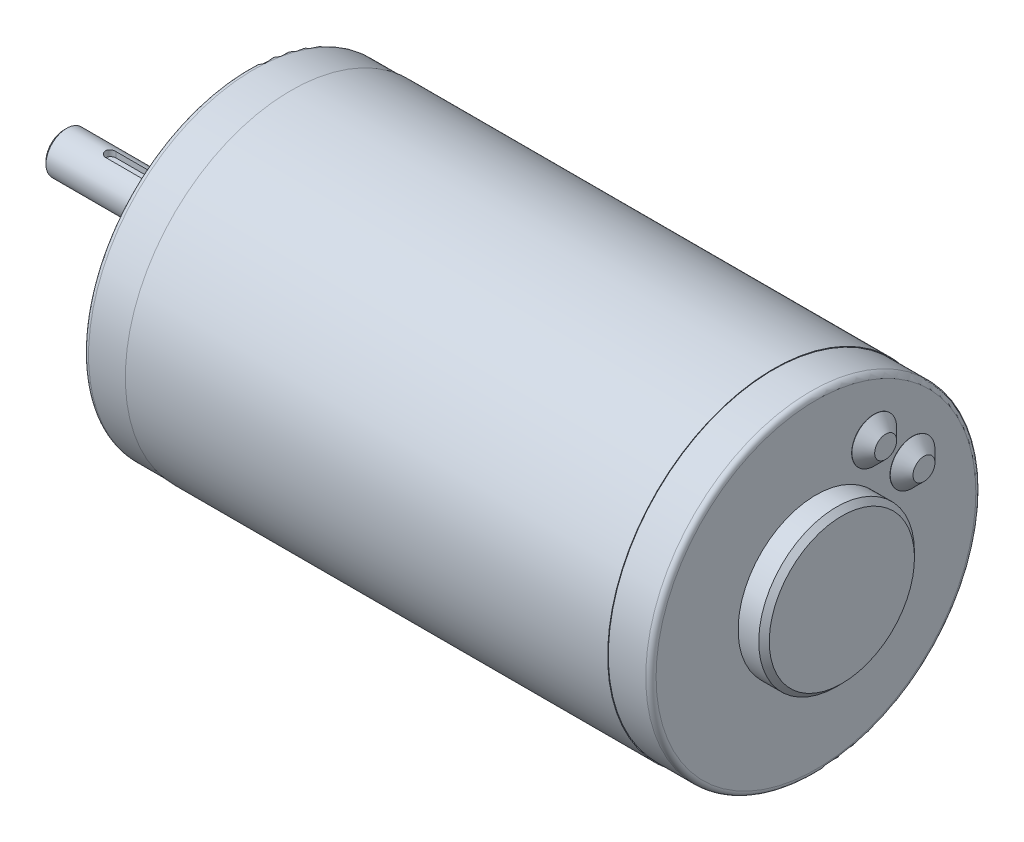
ISO-10303-21;
HEADER;
FILE_DESCRIPTION(('STEP AP214'),'2;1');
FILE_NAME('part.step','',(''),(''),'','','');
FILE_SCHEMA(('AUTOMOTIVE_DESIGN { 1 0 10303 214 1 1 1 1 }'));
ENDSEC;
DATA;
#1=APPLICATION_CONTEXT('core data for automotive mechanical design processes');
#2=APPLICATION_PROTOCOL_DEFINITION('international standard','automotive_design',2000,#1);
#3=PRODUCT_CONTEXT('',#1,'mechanical');
#4=PRODUCT('Part','Part','',(#3));
#5=PRODUCT_RELATED_PRODUCT_CATEGORY('part','',(#4));
#6=PRODUCT_DEFINITION_FORMATION('','',#4);
#7=PRODUCT_DEFINITION_CONTEXT('part definition',#1,'design');
#8=PRODUCT_DEFINITION('design','',#6,#7);
#9=PRODUCT_DEFINITION_SHAPE('','',#8);
#10=(LENGTH_UNIT() NAMED_UNIT(*) SI_UNIT(.MILLI.,.METRE.));
#11=(NAMED_UNIT(*) PLANE_ANGLE_UNIT() SI_UNIT($,.RADIAN.));
#12=(NAMED_UNIT(*) SI_UNIT($,.STERADIAN.) SOLID_ANGLE_UNIT());
#13=UNCERTAINTY_MEASURE_WITH_UNIT(LENGTH_MEASURE(1.E-05),#10,'distance_accuracy_value','');
#14=(GEOMETRIC_REPRESENTATION_CONTEXT(3) GLOBAL_UNCERTAINTY_ASSIGNED_CONTEXT((#13)) GLOBAL_UNIT_ASSIGNED_CONTEXT((#10,
#11,#12)) REPRESENTATION_CONTEXT('',''));
#15=CARTESIAN_POINT('',(0.,0.,0.));
#16=DIRECTION('',(0.,0.,1.));
#17=DIRECTION('',(1.,0.,0.));
#18=AXIS2_PLACEMENT_3D('',#15,#16,#17);
#19=CARTESIAN_POINT('',(-27.6,2.79999999999999,-1.));
#20=DIRECTION('',(0.,-1.,0.));
#21=DIRECTION('',(0.,0.,-1.));
#22=AXIS2_PLACEMENT_3D('',#19,#20,#21);
#23=PLANE('',#22);
#24=CARTESIAN_POINT('',(-7.1,2.79999999999999,0.));
#25=DIRECTION('',(0.,1.,0.));
#26=DIRECTION('',(0.,0.,1.));
#27=AXIS2_PLACEMENT_3D('',#24,#25,#26);
#28=CIRCLE('',#27,1.);
#29=CARTESIAN_POINT('',(-7.1,2.79999999999999,1.));
#30=VERTEX_POINT('',#29);
#31=CARTESIAN_POINT('',(-7.1,2.79999999999999,-1.));
#32=VERTEX_POINT('',#31);
#33=EDGE_CURVE('E79',#30,#32,#28,.T.);
#34=ORIENTED_EDGE('',*,*,#33,.T.);
#35=DIRECTION('',(1.,0.,0.));
#36=VECTOR('',#35,1.);
#37=CARTESIAN_POINT('',(-27.6,2.79999999999999,-1.));
#38=LINE('',#37,#36);
#39=CARTESIAN_POINT('',(-26.6,2.79999999999999,-1.));
#40=VERTEX_POINT('',#39);
#41=EDGE_CURVE('E74',#40,#32,#38,.T.);
#42=ORIENTED_EDGE('',*,*,#41,.F.);
#43=CARTESIAN_POINT('',(-26.6,2.79999999999999,0.));
#44=DIRECTION('',(0.,-1.,0.));
#45=DIRECTION('',(0.,0.,-1.));
#46=AXIS2_PLACEMENT_3D('',#43,#44,#45);
#47=CIRCLE('',#46,1.);
#48=CARTESIAN_POINT('',(-26.6,2.79999999999999,1.));
#49=VERTEX_POINT('',#48);
#50=EDGE_CURVE('E76',#40,#49,#47,.F.);
#51=ORIENTED_EDGE('',*,*,#50,.T.);
#52=DIRECTION('',(1.,0.,0.));
#53=VECTOR('',#52,1.);
#54=CARTESIAN_POINT('',(-27.6,2.79999999999999,1.));
#55=LINE('',#54,#53);
#56=EDGE_CURVE('E102',#49,#30,#55,.T.);
#57=ORIENTED_EDGE('',*,*,#56,.T.);
#58=EDGE_LOOP('',(#34,#42,#51,#57));
#59=FACE_BOUND('',#58,.T.);
#60=ADVANCED_FACE('F16',(#59),#23,.F.);
#61=CARTESIAN_POINT('',(-35.6,0.,0.));
#62=DIRECTION('',(-1.,0.,0.));
#63=DIRECTION('',(0.,0.,1.));
#64=AXIS2_PLACEMENT_3D('',#61,#62,#63);
#65=PLANE('',#64);
#66=CARTESIAN_POINT('',(-35.6000000000449,0.,0.));
#67=DIRECTION('',(1.,0.,0.));
#68=DIRECTION('',(0.,0.,-1.));
#69=AXIS2_PLACEMENT_3D('',#66,#67,#68);
#70=CIRCLE('',#69,3.49999999997408);
#71=CARTESIAN_POINT('',(-35.6000000000449,0.,-3.49999999997408));
#72=VERTEX_POINT('',#71);
#73=EDGE_CURVE('E325',#72,#72,#70,.T.);
#74=ORIENTED_EDGE('',*,*,#73,.F.);
#75=EDGE_LOOP('',(#74));
#76=FACE_BOUND('',#75,.T.);
#77=ADVANCED_FACE('F578',(#76),#65,.T.);
#78=CARTESIAN_POINT('',(-26.6,3.87298334620741,0.));
#79=DIRECTION('',(0.,-1.,0.));
#80=DIRECTION('',(0.,0.,-1.));
#81=AXIS2_PLACEMENT_3D('',#78,#79,#80);
#82=CYLINDRICAL_SURFACE('',#81,1.);
#83=CARTESIAN_POINT('',(-26.6,3.87298334620741,1.));
#84=CARTESIAN_POINT('',(-26.6276629851065,3.87298148580177,1.00000033749611));
#85=CARTESIAN_POINT('',(-26.6553122630182,3.8732800994947,0.998851407375366));
#86=CARTESIAN_POINT('',(-26.7104040353036,3.87445904774558,0.994271295395754));
#87=CARTESIAN_POINT('',(-26.7378465636871,3.87533928441687,0.990840497572679));
#88=CARTESIAN_POINT('',(-26.8194531732088,3.87881710972053,0.977175239382526));
#89=CARTESIAN_POINT('',(-26.8730564684822,3.88225203148808,0.963567695172493));
#90=CARTESIAN_POINT('',(-26.977124673782,3.89095422588002,0.927798076247996));
#91=CARTESIAN_POINT('',(-27.0275898782129,3.89622132630929,0.905636805423835));
#92=CARTESIAN_POINT('',(-27.1241114486473,3.90799134471939,0.853415378025864));
#93=CARTESIAN_POINT('',(-27.170166627891,3.91449459395647,0.823353103356932));
#94=CARTESIAN_POINT('',(-27.2575438819061,3.92816262398025,0.755484471828069));
#95=CARTESIAN_POINT('',(-27.2987548862455,3.93533791028915,0.717537268783975));
#96=CARTESIAN_POINT('',(-27.3743020894827,3.94945104396193,0.635275780516229));
#97=CARTESIAN_POINT('',(-27.4086371894679,3.95638885322537,0.59096047947883));
#98=CARTESIAN_POINT('',(-27.4699110016186,3.96936182283248,0.496456899401689));
#99=CARTESIAN_POINT('',(-27.496739895984,3.9753830468173,0.446195340334472));
#100=CARTESIAN_POINT('',(-27.5415247341967,3.98572346250588,0.341702590842916));
#101=CARTESIAN_POINT('',(-27.5594824242998,3.990042989147,0.287472184083007));
#102=CARTESIAN_POINT('',(-27.5856589927774,3.99641900005128,0.177744108525158));
#103=CARTESIAN_POINT('',(-27.5940676724228,3.998519529013,0.122294322002856));
#104=CARTESIAN_POINT('',(-27.6015033715433,4.00037438150815,0.0107327756816781));
#105=CARTESIAN_POINT('',(-27.6005315701923,4.00012899993444,-0.0453789000287067));
#106=CARTESIAN_POINT('',(-27.5893700363146,3.99735237365735,-0.155352492972096));
#107=CARTESIAN_POINT('',(-27.5793853834005,3.9948719867736,-0.209236701739855));
#108=CARTESIAN_POINT('',(-27.5508113208173,3.98796330636495,-0.31453871108434));
#109=CARTESIAN_POINT('',(-27.5322215304314,3.98353492665556,-0.365956402423988));
#110=CARTESIAN_POINT('',(-27.4867987193294,3.97314997761798,-0.46540728602454));
#111=CARTESIAN_POINT('',(-27.4598926057672,3.96717993827555,-0.513405629602248));
#112=CARTESIAN_POINT('',(-27.3986568701665,3.95435945541919,-0.604276631230015));
#113=CARTESIAN_POINT('',(-27.3643261297468,3.94750887933198,-0.64714851556229));
#114=CARTESIAN_POINT('',(-27.2881210879187,3.93345566022865,-0.727769389708492));
#115=CARTESIAN_POINT('',(-27.2460683634602,3.92624850477685,-0.765349103054128));
#116=CARTESIAN_POINT('',(-27.1561701330723,3.91246168284006,-0.832969575186237));
#117=CARTESIAN_POINT('',(-27.1083230467164,3.90588218842993,-0.863008270245062));
#118=CARTESIAN_POINT('',(-27.0078544021762,3.89407813586325,-0.914804709285961));
#119=CARTESIAN_POINT('',(-26.9552085351039,3.88886106009136,-0.936517017887269));
#120=CARTESIAN_POINT('',(-26.8468830715817,3.88047058807054,-0.970702351849828));
#121=CARTESIAN_POINT('',(-26.7912081448502,3.87729413761435,-0.983189189212131));
#122=CARTESIAN_POINT('',(-26.7125426192411,3.87455290681524,-0.993904635150938));
#123=CARTESIAN_POINT('',(-26.6900802967868,3.87396523110859,-0.996190790966708));
#124=CARTESIAN_POINT('',(-26.6450822100907,3.87318062488974,-0.999236757697394));
#125=CARTESIAN_POINT('',(-26.6225466240447,3.87298306219461,-0.999999038096045));
#126=CARTESIAN_POINT('',(-26.6,3.87298334620741,-1.));
#127=B_SPLINE_CURVE_WITH_KNOTS('',3,(#83,#84,#85,#86,#87,#88,#89,#90,#91,#92,#93,#94,#95,#96,
#97,#98,#99,#100,#101,#102,#103,#104,#105,#106,#107,#108,#109,#110,#111,#112,#113,#114,#115,
#116,#117,#118,#119,#120,#121,#122,#123,#124,#125,#126),.UNSPECIFIED.,.F.,.F.,(4,2,2,2,2,2,2,2,
2,2,2,2,2,2,2,2,2,2,2,2,2,4),(0.,0.0829365303397727,0.165859106084653,0.331229963080318,
0.496585282091499,0.661984974726751,0.830641897427976,0.999325753539196,1.17036187098235,
1.34136430732425,1.50890481515325,1.67642426256639,1.84022545479276,2.00403389475838,
2.16932509450376,2.33464120964329,2.50441429534542,2.67423379180967,2.84496720161068,
3.01544447539986,3.08315848722649,3.15076267731671),.UNSPECIFIED.);
#128=CARTESIAN_POINT('',(-26.6,3.87298334620741,1.));
#129=VERTEX_POINT('',#128);
#130=CARTESIAN_POINT('',(-26.6,3.87298334620741,-1.));
#131=VERTEX_POINT('',#130);
#132=EDGE_CURVE('E160',#129,#131,#127,.T.);
#133=ORIENTED_EDGE('',*,*,#132,.F.);
#134=DIRECTION('',(0.,1.,0.));
#135=VECTOR('',#134,1.);
#136=CARTESIAN_POINT('',(-26.6,2.79999999999999,1.));
#137=LINE('',#136,#135);
#138=EDGE_CURVE('E89',#129,#49,#137,.F.);
#139=ORIENTED_EDGE('',*,*,#138,.T.);
#140=ORIENTED_EDGE('',*,*,#50,.F.);
#141=DIRECTION('',(0.,1.,0.));
#142=VECTOR('',#141,1.);
#143=CARTESIAN_POINT('',(-26.6,2.79999999999999,-1.));
#144=LINE('',#143,#142);
#145=EDGE_CURVE('E83',#131,#40,#144,.F.);
#146=ORIENTED_EDGE('',*,*,#145,.F.);
#147=EDGE_LOOP('',(#133,#139,#140,#146));
#148=FACE_BOUND('',#147,.T.);
#149=ADVANCED_FACE('F86',(#148),#82,.F.);
#150=CARTESIAN_POINT('',(-27.6,2.79999999999999,-1.));
#151=DIRECTION('',(0.,0.,1.));
#152=DIRECTION('',(1.,0.,0.));
#153=AXIS2_PLACEMENT_3D('',#150,#151,#152);
#154=PLANE('',#153);
#155=DIRECTION('',(1.,0.,0.));
#156=VECTOR('',#155,1.);
#157=CARTESIAN_POINT('',(0.,3.87298334620741,-1.));
#158=LINE('',#157,#156);
#159=CARTESIAN_POINT('',(-7.1,3.87298334620741,-1.));
#160=VERTEX_POINT('',#159);
#161=EDGE_CURVE('E94',#131,#160,#158,.T.);
#162=ORIENTED_EDGE('',*,*,#161,.F.);
#163=ORIENTED_EDGE('',*,*,#145,.T.);
#164=ORIENTED_EDGE('',*,*,#41,.T.);
#165=DIRECTION('',(0.,1.,0.));
#166=VECTOR('',#165,1.);
#167=CARTESIAN_POINT('',(-7.1,2.79999999999999,-1.));
#168=LINE('',#167,#166);
#169=EDGE_CURVE('E97',#32,#160,#168,.T.);
#170=ORIENTED_EDGE('',*,*,#169,.T.);
#171=EDGE_LOOP('',(#162,#163,#164,#170));
#172=FACE_BOUND('',#171,.T.);
#173=ADVANCED_FACE('F92',(#172),#154,.T.);
#174=CARTESIAN_POINT('',(-7.1,2.79999999999999,0.));
#175=DIRECTION('',(0.,1.,0.));
#176=DIRECTION('',(0.,0.,1.));
#177=AXIS2_PLACEMENT_3D('',#174,#175,#176);
#178=CYLINDRICAL_SURFACE('',#177,1.);
#179=ORIENTED_EDGE('',*,*,#33,.F.);
#180=DIRECTION('',(0.,1.,0.));
#181=VECTOR('',#180,1.);
#182=CARTESIAN_POINT('',(-7.1,2.79999999999999,1.));
#183=LINE('',#182,#181);
#184=CARTESIAN_POINT('',(-7.1,3.87298334620741,1.));
#185=VERTEX_POINT('',#184);
#186=EDGE_CURVE('E103',#30,#185,#183,.T.);
#187=ORIENTED_EDGE('',*,*,#186,.T.);
#188=CARTESIAN_POINT('',(-7.1,3.87298334620741,-1.));
#189=CARTESIAN_POINT('',(-7.07233701489346,3.87298148580177,-1.00000033749611));
#190=CARTESIAN_POINT('',(-7.04468773698177,3.8732800994947,-0.998851407375366));
#191=CARTESIAN_POINT('',(-6.98959596469644,3.87445904774558,-0.994271295395754));
#192=CARTESIAN_POINT('',(-6.96215343631291,3.87533928441687,-0.990840497572679));
#193=CARTESIAN_POINT('',(-6.88054682679116,3.87881710972053,-0.977175239382526));
#194=CARTESIAN_POINT('',(-6.82694353151779,3.88225203148808,-0.963567695172493));
#195=CARTESIAN_POINT('',(-6.72287532621804,3.89095422588002,-0.927798076247997));
#196=CARTESIAN_POINT('',(-6.67241012178714,3.89622132630929,-0.905636805423836));
#197=CARTESIAN_POINT('',(-6.57588855135267,3.90799134471939,-0.853415378025865));
#198=CARTESIAN_POINT('',(-6.52983337210904,3.91449459395647,-0.823353103356933));
#199=CARTESIAN_POINT('',(-6.4424561180939,3.92816262398025,-0.755484471828069));
#200=CARTESIAN_POINT('',(-6.40124511375448,3.93533791028915,-0.717537268783976));
#201=CARTESIAN_POINT('',(-6.32569791051729,3.94945104396193,-0.63527578051623));
#202=CARTESIAN_POINT('',(-6.29136281053206,3.95638885322537,-0.590960479478831));
#203=CARTESIAN_POINT('',(-6.23008899838136,3.96936182283248,-0.496456899401691));
#204=CARTESIAN_POINT('',(-6.20326010401603,3.9753830468173,-0.446195340334474));
#205=CARTESIAN_POINT('',(-6.1584752658033,3.98572346250588,-0.341702590842919));
#206=CARTESIAN_POINT('',(-6.14051757570017,3.990042989147,-0.28747218408301));
#207=CARTESIAN_POINT('',(-6.11434100722257,3.99641900005128,-0.17774410852516));
#208=CARTESIAN_POINT('',(-6.10593232757718,3.998519529013,-0.122294322002858));
#209=CARTESIAN_POINT('',(-6.09849662845671,4.00037438150815,-0.0107327756816796));
#210=CARTESIAN_POINT('',(-6.09946842980766,4.00012899993444,0.0453789000287057));
#211=CARTESIAN_POINT('',(-6.11062996368545,3.99735237365735,0.155352492972096));
#212=CARTESIAN_POINT('',(-6.12061461659948,3.9948719867736,0.209236701739855));
#213=CARTESIAN_POINT('',(-6.14918867918275,3.98796330636495,0.31453871108434));
#214=CARTESIAN_POINT('',(-6.16777846956858,3.98353492665556,0.365956402423988));
#215=CARTESIAN_POINT('',(-6.21320128067065,3.97314997761798,0.465407286024539));
#216=CARTESIAN_POINT('',(-6.24010739423284,3.96717993827555,0.513405629602248));
#217=CARTESIAN_POINT('',(-6.30134312983347,3.95435945541919,0.604276631230014));
#218=CARTESIAN_POINT('',(-6.33567387025322,3.94750887933198,0.647148515562289));
#219=CARTESIAN_POINT('',(-6.41187891208131,3.93345566022865,0.72776938970849));
#220=CARTESIAN_POINT('',(-6.45393163653981,3.92624850477685,0.765349103054127));
#221=CARTESIAN_POINT('',(-6.54382986692773,3.91246168284006,0.832969575186237));
#222=CARTESIAN_POINT('',(-6.59167695328356,3.90588218842993,0.863008270245062));
#223=CARTESIAN_POINT('',(-6.69214559782377,3.89407813586325,0.914804709285962));
#224=CARTESIAN_POINT('',(-6.74479146489609,3.88886106009136,0.936517017887269));
#225=CARTESIAN_POINT('',(-6.85311692841829,3.88047058807055,0.970702351849829));
#226=CARTESIAN_POINT('',(-6.90879185514984,3.87729413761435,0.983189189212132));
#227=CARTESIAN_POINT('',(-6.9874573807589,3.87455290681524,0.993904635150938));
#228=CARTESIAN_POINT('',(-7.00991970321318,3.87396523110859,0.996190790966708));
#229=CARTESIAN_POINT('',(-7.05491778990932,3.87318062488974,0.999236757697394));
#230=CARTESIAN_POINT('',(-7.07745337595529,3.87298306219461,0.999999038096045));
#231=CARTESIAN_POINT('',(-7.1,3.87298334620741,1.));
#232=B_SPLINE_CURVE_WITH_KNOTS('',3,(#188,#189,#190,#191,#192,#193,#194,#195,#196,#197,#198,
#199,#200,#201,#202,#203,#204,#205,#206,#207,#208,#209,#210,#211,#212,#213,#214,#215,#216,#217,
#218,#219,#220,#221,#222,#223,#224,#225,#226,#227,#228,#229,#230,#231),.UNSPECIFIED.,.F.,.F.,(4,
2,2,2,2,2,2,2,2,2,2,2,2,2,2,2,2,2,2,2,2,4),(0.,0.0829365303397693,0.165859106084651,
0.331229963080317,0.496585282091498,0.661984974726749,0.830641897427974,0.999325753539193,
1.17036187098235,1.34136430732424,1.50890481515325,1.67642426256639,1.84022545479276,
2.00403389475838,2.16932509450376,2.33464120964329,2.50441429534542,2.67423379180967,
2.84496720161068,3.01544447539986,3.08315848722648,3.15076267731671),.UNSPECIFIED.);
#233=EDGE_CURVE('E151',#160,#185,#232,.T.);
#234=ORIENTED_EDGE('',*,*,#233,.F.);
#235=ORIENTED_EDGE('',*,*,#169,.F.);
#236=EDGE_LOOP('',(#179,#187,#234,#235));
#237=FACE_BOUND('',#236,.T.);
#238=ADVANCED_FACE('F166',(#237),#178,.F.);
#239=CARTESIAN_POINT('',(-27.6,2.79999999999999,1.));
#240=DIRECTION('',(0.,0.,1.));
#241=DIRECTION('',(1.,0.,0.));
#242=AXIS2_PLACEMENT_3D('',#239,#240,#241);
#243=PLANE('',#242);
#244=ORIENTED_EDGE('',*,*,#186,.F.);
#245=ORIENTED_EDGE('',*,*,#56,.F.);
#246=ORIENTED_EDGE('',*,*,#138,.F.);
#247=DIRECTION('',(1.,0.,0.));
#248=VECTOR('',#247,1.);
#249=CARTESIAN_POINT('',(0.,3.87298334620741,1.));
#250=LINE('',#249,#248);
#251=EDGE_CURVE('E159',#185,#129,#250,.F.);
#252=ORIENTED_EDGE('',*,*,#251,.F.);
#253=EDGE_LOOP('',(#244,#245,#246,#252));
#254=FACE_BOUND('',#253,.T.);
#255=ADVANCED_FACE('F181',(#254),#243,.F.);
#256=CARTESIAN_POINT('',(-35.0999999999999,0.,0.));
#257=DIRECTION('',(1.,0.,0.));
#258=DIRECTION('',(0.,0.,-1.));
#259=AXIS2_PLACEMENT_3D('',#256,#257,#258);
#260=CONICAL_SURFACE('',#259,3.99999999996226,0.785398163340605);
#261=ORIENTED_EDGE('',*,*,#73,.T.);
#262=EDGE_LOOP('',(#261));
#263=FACE_BOUND('',#262,.T.);
#264=CARTESIAN_POINT('',(-35.1,0.,0.));
#265=DIRECTION('',(1.,0.,0.));
#266=DIRECTION('',(0.,0.,-1.));
#267=AXIS2_PLACEMENT_3D('',#264,#265,#266);
#268=CIRCLE('',#267,4.);
#269=CARTESIAN_POINT('',(-35.1,0.,-4.));
#270=VERTEX_POINT('',#269);
#271=EDGE_CURVE('E150',#270,#270,#268,.T.);
#272=ORIENTED_EDGE('',*,*,#271,.F.);
#273=EDGE_LOOP('',(#272));
#274=FACE_BOUND('',#273,.T.);
#275=ADVANCED_FACE('F176',(#263,#274),#260,.T.);
#276=CARTESIAN_POINT('',(0.,0.,0.));
#277=DIRECTION('',(1.,0.,0.));
#278=DIRECTION('',(0.,0.,-1.));
#279=AXIS2_PLACEMENT_3D('',#276,#277,#278);
#280=CYLINDRICAL_SURFACE('',#279,4.);
#281=ORIENTED_EDGE('',*,*,#271,.T.);
#282=EDGE_LOOP('',(#281));
#283=FACE_BOUND('',#282,.T.);
#284=CARTESIAN_POINT('',(-4.,0.,0.));
#285=DIRECTION('',(1.,0.,0.));
#286=DIRECTION('',(0.,0.,-1.));
#287=AXIS2_PLACEMENT_3D('',#284,#285,#286);
#288=CIRCLE('',#287,4.);
#289=CARTESIAN_POINT('',(-4.,0.,-4.));
#290=VERTEX_POINT('',#289);
#291=EDGE_CURVE('E147',#290,#290,#288,.T.);
#292=ORIENTED_EDGE('',*,*,#291,.F.);
#293=EDGE_LOOP('',(#292));
#294=FACE_BOUND('',#293,.T.);
#295=ORIENTED_EDGE('',*,*,#233,.T.);
#296=ORIENTED_EDGE('',*,*,#251,.T.);
#297=ORIENTED_EDGE('',*,*,#132,.T.);
#298=ORIENTED_EDGE('',*,*,#161,.T.);
#299=EDGE_LOOP('',(#295,#296,#297,#298));
#300=FACE_BOUND('',#299,.T.);
#301=ADVANCED_FACE('F170',(#283,#294,#300),#280,.T.);
#302=CARTESIAN_POINT('',(-4.,4.,0.));
#303=DIRECTION('',(-1.,0.,0.));
#304=DIRECTION('',(0.,0.,1.));
#305=AXIS2_PLACEMENT_3D('',#302,#303,#304);
#306=PLANE('',#305);
#307=ORIENTED_EDGE('',*,*,#291,.T.);
#308=EDGE_LOOP('',(#307));
#309=FACE_BOUND('',#308,.T.);
#310=CARTESIAN_POINT('',(-4.,0.,0.));
#311=DIRECTION('',(1.,0.,0.));
#312=DIRECTION('',(0.,1.,0.));
#313=AXIS2_PLACEMENT_3D('',#310,#311,#312);
#314=CIRCLE('',#313,8.509);
#315=CARTESIAN_POINT('',(-4.,8.509,0.));
#316=VERTEX_POINT('',#315);
#317=EDGE_CURVE('E144',#316,#316,#314,.T.);
#318=ORIENTED_EDGE('',*,*,#317,.F.);
#319=EDGE_LOOP('',(#318));
#320=FACE_BOUND('',#319,.T.);
#321=ADVANCED_FACE('F175',(#309,#320),#306,.T.);
#322=CARTESIAN_POINT('',(111.8479,18.6070906828553,-11.2073596390943));
#323=DIRECTION('',(1.,0.,0.));
#324=DIRECTION('',(0.,0.,-1.));
#325=AXIS2_PLACEMENT_3D('',#322,#323,#324);
#326=PLANE('',#325);
#327=CARTESIAN_POINT('',(111.84789999993,18.6070906828553,-11.2073596390943));
#328=DIRECTION('',(-1.,0.,0.));
#329=DIRECTION('',(0.,-1.,0.));
#330=AXIS2_PLACEMENT_3D('',#327,#328,#329);
#331=CIRCLE('',#330,2.11800000003146);
#332=CARTESIAN_POINT('',(111.84789999993,16.4890906828238,-11.2073596390943));
#333=VERTEX_POINT('',#332);
#334=EDGE_CURVE('E141',#333,#333,#331,.T.);
#335=ORIENTED_EDGE('',*,*,#334,.F.);
#336=EDGE_LOOP('',(#335));
#337=FACE_BOUND('',#336,.T.);
#338=ADVANCED_FACE('F530',(#337),#326,.T.);
#339=CARTESIAN_POINT('',(114.6,15.0368,0.));
#340=DIRECTION('',(1.,0.,0.));
#341=DIRECTION('',(0.,0.,-1.));
#342=AXIS2_PLACEMENT_3D('',#339,#340,#341);
#343=PLANE('',#342);
#344=CARTESIAN_POINT('',(114.6,0.,0.));
#345=DIRECTION('',(-1.,0.,0.));
#346=DIRECTION('',(0.,-1.,0.));
#347=AXIS2_PLACEMENT_3D('',#344,#345,#346);
#348=CIRCLE('',#347,14.0208);
#349=CARTESIAN_POINT('',(114.6,-14.0208,0.));
#350=VERTEX_POINT('',#349);
#351=EDGE_CURVE('E138',#350,#350,#348,.T.);
#352=ORIENTED_EDGE('',*,*,#351,.F.);
#353=EDGE_LOOP('',(#352));
#354=FACE_BOUND('',#353,.T.);
#355=ADVANCED_FACE('F521',(#354),#343,.T.);
#356=CARTESIAN_POINT('',(111.8479,11.2073596390943,-18.6070906828553));
#357=DIRECTION('',(1.,0.,0.));
#358=DIRECTION('',(0.,0.,-1.));
#359=AXIS2_PLACEMENT_3D('',#356,#357,#358);
#360=PLANE('',#359);
#361=CARTESIAN_POINT('',(111.84789999993,11.2073596390943,-18.6070906828553));
#362=DIRECTION('',(-1.,0.,0.));
#363=DIRECTION('',(0.,0.,1.));
#364=AXIS2_PLACEMENT_3D('',#361,#362,#363);
#365=CIRCLE('',#364,2.1180000000021);
#366=CARTESIAN_POINT('',(111.84789999993,11.2073596390943,-16.4890906828532));
#367=VERTEX_POINT('',#366);
#368=EDGE_CURVE('E134',#367,#367,#365,.T.);
#369=ORIENTED_EDGE('',*,*,#368,.F.);
#370=EDGE_LOOP('',(#369));
#371=FACE_BOUND('',#370,.T.);
#372=ADVANCED_FACE('F512',(#371),#360,.T.);
#373=CARTESIAN_POINT('',(13.6143999999945,25.4,0.));
#374=DIRECTION('',(-1.,0.,0.));
#375=DIRECTION('',(0.,0.,1.));
#376=AXIS2_PLACEMENT_3D('',#373,#374,#375);
#377=CONICAL_SURFACE('',#376,2.01929999997219,1.02974425867198);
#378=CARTESIAN_POINT('',(14.827717847993,25.4,0.));
#379=VERTEX_POINT('',#378);
#380=VERTEX_LOOP('',#379);
#381=FACE_BOUND('',#380,.T.);
#382=CARTESIAN_POINT('',(13.6144,25.4,0.));
#383=DIRECTION('',(-1.,0.,0.));
#384=DIRECTION('',(0.,0.,1.));
#385=AXIS2_PLACEMENT_3D('',#382,#383,#384);
#386=CIRCLE('',#385,2.0193);
#387=CARTESIAN_POINT('',(13.6144,25.4,2.0193));
#388=VERTEX_POINT('',#387);
#389=EDGE_CURVE('E137',#388,#388,#386,.T.);
#390=ORIENTED_EDGE('',*,*,#389,.T.);
#391=EDGE_LOOP('',(#390));
#392=FACE_BOUND('',#391,.T.);
#393=ADVANCED_FACE('F503',(#381,#392),#377,.F.);
#394=CARTESIAN_POINT('',(13.6143999999945,-25.4,0.));
#395=DIRECTION('',(-1.,0.,0.));
#396=DIRECTION('',(0.,0.,1.));
#397=AXIS2_PLACEMENT_3D('',#394,#395,#396);
#398=CONICAL_SURFACE('',#397,2.01929999997219,1.02974425867198);
#399=CARTESIAN_POINT('',(14.827717847993,-25.4,0.));
#400=VERTEX_POINT('',#399);
#401=VERTEX_LOOP('',#400);
#402=FACE_BOUND('',#401,.T.);
#403=CARTESIAN_POINT('',(13.6144,-25.4,0.));
#404=DIRECTION('',(-1.,0.,0.));
#405=DIRECTION('',(0.,0.,1.));
#406=AXIS2_PLACEMENT_3D('',#403,#404,#405);
#407=CIRCLE('',#406,2.0193);
#408=CARTESIAN_POINT('',(13.6144,-25.4,2.0193));
#409=VERTEX_POINT('',#408);
#410=EDGE_CURVE('E315',#409,#409,#407,.T.);
#411=ORIENTED_EDGE('',*,*,#410,.T.);
#412=EDGE_LOOP('',(#411));
#413=FACE_BOUND('',#412,.T.);
#414=ADVANCED_FACE('F494',(#402,#413),#398,.F.);
#415=CARTESIAN_POINT('',(-2.984,0.,0.));
#416=DIRECTION('',(1.,0.,0.));
#417=DIRECTION('',(0.,1.,0.));
#418=AXIS2_PLACEMENT_3D('',#415,#416,#417);
#419=CONICAL_SURFACE('',#418,9.525,0.78539816339745);
#420=ORIENTED_EDGE('',*,*,#317,.T.);
#421=EDGE_LOOP('',(#420));
#422=FACE_BOUND('',#421,.T.);
#423=CARTESIAN_POINT('',(-2.984,0.,0.));
#424=DIRECTION('',(1.,0.,0.));
#425=DIRECTION('',(0.,0.,-1.));
#426=AXIS2_PLACEMENT_3D('',#423,#424,#425);
#427=CIRCLE('',#426,9.525);
#428=CARTESIAN_POINT('',(-2.984,0.,-9.525));
#429=VERTEX_POINT('',#428);
#430=EDGE_CURVE('E312',#429,#429,#427,.T.);
#431=ORIENTED_EDGE('',*,*,#430,.F.);
#432=EDGE_LOOP('',(#431));
#433=FACE_BOUND('',#432,.T.);
#434=ADVANCED_FACE('F485',(#422,#433),#419,.T.);
#435=CARTESIAN_POINT('',(109.647900000027,18.6070906828553,-11.2073596390943));
#436=DIRECTION('',(-1.,0.,0.));
#437=DIRECTION('',(0.,-1.,0.));
#438=AXIS2_PLACEMENT_3D('',#435,#436,#437);
#439=CONICAL_SURFACE('',#438,4.31799999987712,0.785398163384529);
#440=CARTESIAN_POINT('',(109.6479,18.6070906828553,-11.2073596390943));
#441=DIRECTION('',(-1.,0.,0.));
#442=DIRECTION('',(0.,0.,1.));
#443=AXIS2_PLACEMENT_3D('',#440,#441,#442);
#444=CIRCLE('',#443,4.318);
#445=CARTESIAN_POINT('',(109.6479,18.6070906828553,-6.88935963909434));
#446=VERTEX_POINT('',#445);
#447=EDGE_CURVE('E309',#446,#446,#444,.T.);
#448=ORIENTED_EDGE('',*,*,#447,.F.);
#449=EDGE_LOOP('',(#448));
#450=FACE_BOUND('',#449,.T.);
#451=ORIENTED_EDGE('',*,*,#334,.T.);
#452=EDGE_LOOP('',(#451));
#453=FACE_BOUND('',#452,.T.);
#454=ADVANCED_FACE('F476',(#450,#453),#439,.T.);
#455=CARTESIAN_POINT('',(113.584,0.,0.));
#456=DIRECTION('',(-1.,0.,0.));
#457=DIRECTION('',(0.,-1.,0.));
#458=AXIS2_PLACEMENT_3D('',#455,#456,#457);
#459=CONICAL_SURFACE('',#458,15.0368,0.785398163397441);
#460=ORIENTED_EDGE('',*,*,#351,.T.);
#461=EDGE_LOOP('',(#460));
#462=FACE_BOUND('',#461,.T.);
#463=CARTESIAN_POINT('',(113.584,0.,0.));
#464=DIRECTION('',(1.,0.,0.));
#465=DIRECTION('',(0.,0.,-1.));
#466=AXIS2_PLACEMENT_3D('',#463,#464,#465);
#467=CIRCLE('',#466,15.0368);
#468=CARTESIAN_POINT('',(113.584,0.,-15.0368));
#469=VERTEX_POINT('',#468);
#470=EDGE_CURVE('E306',#469,#469,#467,.F.);
#471=ORIENTED_EDGE('',*,*,#470,.F.);
#472=EDGE_LOOP('',(#471));
#473=FACE_BOUND('',#472,.T.);
#474=ADVANCED_FACE('F467',(#462,#473),#459,.T.);
#475=CARTESIAN_POINT('',(109.647900000084,11.2073596390943,-18.6070906828553));
#476=DIRECTION('',(-1.,0.,0.));
#477=DIRECTION('',(0.,0.,1.));
#478=AXIS2_PLACEMENT_3D('',#475,#476,#477);
#479=CONICAL_SURFACE('',#478,4.31799999990461,0.785398163410367);
#480=CARTESIAN_POINT('',(109.6479,11.2073596390943,-18.6070906828553));
#481=DIRECTION('',(-1.,0.,0.));
#482=DIRECTION('',(0.,0.,1.));
#483=AXIS2_PLACEMENT_3D('',#480,#481,#482);
#484=CIRCLE('',#483,4.318);
#485=CARTESIAN_POINT('',(109.6479,11.2073596390943,-14.2890906828553));
#486=VERTEX_POINT('',#485);
#487=EDGE_CURVE('E133',#486,#486,#484,.T.);
#488=ORIENTED_EDGE('',*,*,#487,.F.);
#489=EDGE_LOOP('',(#488));
#490=FACE_BOUND('',#489,.T.);
#491=ORIENTED_EDGE('',*,*,#368,.T.);
#492=EDGE_LOOP('',(#491));
#493=FACE_BOUND('',#492,.T.);
#494=ADVANCED_FACE('F458',(#490,#493),#479,.T.);
#495=CARTESIAN_POINT('',(0.,25.4,0.));
#496=DIRECTION('',(-1.,0.,0.));
#497=DIRECTION('',(0.,0.,1.));
#498=AXIS2_PLACEMENT_3D('',#495,#496,#497);
#499=CYLINDRICAL_SURFACE('',#498,2.0193);
#500=CARTESIAN_POINT('',(0.,25.4,0.));
#501=DIRECTION('',(-1.,0.,0.));
#502=DIRECTION('',(0.,0.,1.));
#503=AXIS2_PLACEMENT_3D('',#500,#501,#502);
#504=CIRCLE('',#503,2.0193);
#505=CARTESIAN_POINT('',(0.,25.4,2.0193));
#506=VERTEX_POINT('',#505);
#507=EDGE_CURVE('E130',#506,#506,#504,.F.);
#508=ORIENTED_EDGE('',*,*,#507,.F.);
#509=EDGE_LOOP('',(#508));
#510=FACE_BOUND('',#509,.T.);
#511=ORIENTED_EDGE('',*,*,#389,.F.);
#512=EDGE_LOOP('',(#511));
#513=FACE_BOUND('',#512,.T.);
#514=ADVANCED_FACE('F449',(#510,#513),#499,.F.);
#515=CARTESIAN_POINT('',(0.,-25.4,0.));
#516=DIRECTION('',(-1.,0.,0.));
#517=DIRECTION('',(0.,0.,1.));
#518=AXIS2_PLACEMENT_3D('',#515,#516,#517);
#519=CYLINDRICAL_SURFACE('',#518,2.0193);
#520=CARTESIAN_POINT('',(0.,-25.4,0.));
#521=DIRECTION('',(-1.,0.,0.));
#522=DIRECTION('',(0.,0.,1.));
#523=AXIS2_PLACEMENT_3D('',#520,#521,#522);
#524=CIRCLE('',#523,2.0193);
#525=CARTESIAN_POINT('',(0.,-25.4,2.0193));
#526=VERTEX_POINT('',#525);
#527=EDGE_CURVE('E127',#526,#526,#524,.F.);
#528=ORIENTED_EDGE('',*,*,#527,.F.);
#529=EDGE_LOOP('',(#528));
#530=FACE_BOUND('',#529,.T.);
#531=ORIENTED_EDGE('',*,*,#410,.F.);
#532=EDGE_LOOP('',(#531));
#533=FACE_BOUND('',#532,.T.);
#534=ADVANCED_FACE('F440',(#530,#533),#519,.F.);
#535=CARTESIAN_POINT('',(0.,0.,0.));
#536=DIRECTION('',(1.,0.,0.));
#537=DIRECTION('',(0.,0.,-1.));
#538=AXIS2_PLACEMENT_3D('',#535,#536,#537);
#539=CYLINDRICAL_SURFACE('',#538,9.525);
#540=ORIENTED_EDGE('',*,*,#430,.T.);
#541=EDGE_LOOP('',(#540));
#542=FACE_BOUND('',#541,.T.);
#543=CARTESIAN_POINT('',(0.,0.,0.));
#544=DIRECTION('',(1.,0.,0.));
#545=DIRECTION('',(0.,0.,-1.));
#546=AXIS2_PLACEMENT_3D('',#543,#544,#545);
#547=CIRCLE('',#546,9.525);
#548=CARTESIAN_POINT('',(0.,0.,-9.525));
#549=VERTEX_POINT('',#548);
#550=EDGE_CURVE('E124',#549,#549,#547,.T.);
#551=ORIENTED_EDGE('',*,*,#550,.F.);
#552=EDGE_LOOP('',(#551));
#553=FACE_BOUND('',#552,.T.);
#554=ADVANCED_FACE('F431',(#542,#553),#539,.T.);
#555=CARTESIAN_POINT('',(111.8479,18.6070906828553,-11.2073596390943));
#556=DIRECTION('',(-1.,0.,0.));
#557=DIRECTION('',(0.,0.,1.));
#558=AXIS2_PLACEMENT_3D('',#555,#556,#557);
#559=CYLINDRICAL_SURFACE('',#558,4.318);
#560=CARTESIAN_POINT('',(109.6,18.6070906828553,-11.2073596390943));
#561=DIRECTION('',(-1.,0.,0.));
#562=DIRECTION('',(0.,0.,1.));
#563=AXIS2_PLACEMENT_3D('',#560,#561,#562);
#564=CIRCLE('',#563,4.318);
#565=CARTESIAN_POINT('',(109.6,18.6070906828553,-6.88935963909434));
#566=VERTEX_POINT('',#565);
#567=EDGE_CURVE('E121',#566,#566,#564,.T.);
#568=ORIENTED_EDGE('',*,*,#567,.F.);
#569=EDGE_LOOP('',(#568));
#570=FACE_BOUND('',#569,.T.);
#571=ORIENTED_EDGE('',*,*,#447,.T.);
#572=EDGE_LOOP('',(#571));
#573=FACE_BOUND('',#572,.T.);
#574=ADVANCED_FACE('F422',(#570,#573),#559,.T.);
#575=CARTESIAN_POINT('',(0.,0.,0.));
#576=DIRECTION('',(1.,0.,0.));
#577=DIRECTION('',(0.,0.,-1.));
#578=AXIS2_PLACEMENT_3D('',#575,#576,#577);
#579=CYLINDRICAL_SURFACE('',#578,15.0368);
#580=CARTESIAN_POINT('',(109.6,0.,0.));
#581=DIRECTION('',(1.,0.,0.));
#582=DIRECTION('',(0.,0.,-1.));
#583=AXIS2_PLACEMENT_3D('',#580,#581,#582);
#584=CIRCLE('',#583,15.0368);
#585=CARTESIAN_POINT('',(109.6,0.,-15.0368));
#586=VERTEX_POINT('',#585);
#587=EDGE_CURVE('E118',#586,#586,#584,.F.);
#588=ORIENTED_EDGE('',*,*,#587,.F.);
#589=EDGE_LOOP('',(#588));
#590=FACE_BOUND('',#589,.T.);
#591=ORIENTED_EDGE('',*,*,#470,.T.);
#592=EDGE_LOOP('',(#591));
#593=FACE_BOUND('',#592,.T.);
#594=ADVANCED_FACE('F414',(#590,#593),#579,.T.);
#595=CARTESIAN_POINT('',(111.8479,11.2073596390943,-18.6070906828553));
#596=DIRECTION('',(-1.,0.,0.));
#597=DIRECTION('',(0.,0.,1.));
#598=AXIS2_PLACEMENT_3D('',#595,#596,#597);
#599=CYLINDRICAL_SURFACE('',#598,4.318);
#600=CARTESIAN_POINT('',(109.6,11.2073596390943,-18.6070906828553));
#601=DIRECTION('',(-1.,0.,0.));
#602=DIRECTION('',(0.,0.,1.));
#603=AXIS2_PLACEMENT_3D('',#600,#601,#602);
#604=CIRCLE('',#603,4.318);
#605=CARTESIAN_POINT('',(109.6,11.2073596390943,-14.2890906828553));
#606=VERTEX_POINT('',#605);
#607=EDGE_CURVE('E114',#606,#606,#604,.T.);
#608=ORIENTED_EDGE('',*,*,#607,.F.);
#609=EDGE_LOOP('',(#608));
#610=FACE_BOUND('',#609,.T.);
#611=ORIENTED_EDGE('',*,*,#487,.T.);
#612=EDGE_LOOP('',(#611));
#613=FACE_BOUND('',#612,.T.);
#614=ADVANCED_FACE('F406',(#610,#613),#599,.T.);
#615=CARTESIAN_POINT('',(0.,9.525,0.));
#616=DIRECTION('',(-1.,0.,0.));
#617=DIRECTION('',(0.,0.,1.));
#618=AXIS2_PLACEMENT_3D('',#615,#616,#617);
#619=PLANE('',#618);
#620=ORIENTED_EDGE('',*,*,#550,.T.);
#621=EDGE_LOOP('',(#620));
#622=FACE_BOUND('',#621,.T.);
#623=CARTESIAN_POINT('',(0.,0.,0.));
#624=DIRECTION('',(1.,0.,0.));
#625=DIRECTION('',(0.,0.,-1.));
#626=AXIS2_PLACEMENT_3D('',#623,#624,#625);
#627=CIRCLE('',#626,30.877);
#628=CARTESIAN_POINT('',(0.,0.,-30.877));
#629=VERTEX_POINT('',#628);
#630=CARTESIAN_POINT('',(0.,0.,30.877));
#631=VERTEX_POINT('',#630);
#632=EDGE_CURVE('E117',#629,#631,#627,.T.);
#633=ORIENTED_EDGE('',*,*,#632,.F.);
#634=CARTESIAN_POINT('',(0.,0.,0.));
#635=DIRECTION('',(1.,0.,0.));
#636=DIRECTION('',(0.,0.,1.));
#637=AXIS2_PLACEMENT_3D('',#634,#635,#636);
#638=CIRCLE('',#637,30.877);
#639=EDGE_CURVE('E285',#631,#629,#638,.T.);
#640=ORIENTED_EDGE('',*,*,#639,.F.);
#641=EDGE_LOOP('',(#633,#640));
#642=FACE_BOUND('',#641,.T.);
#643=ORIENTED_EDGE('',*,*,#527,.T.);
#644=EDGE_LOOP('',(#643));
#645=FACE_BOUND('',#644,.T.);
#646=ORIENTED_EDGE('',*,*,#507,.T.);
#647=EDGE_LOOP('',(#646));
#648=FACE_BOUND('',#647,.T.);
#649=ADVANCED_FACE('F251',(#622,#642,#645,#648),#619,.T.);
#650=CARTESIAN_POINT('',(109.6,31.877,0.));
#651=DIRECTION('',(1.,0.,0.));
#652=DIRECTION('',(0.,0.,-1.));
#653=AXIS2_PLACEMENT_3D('',#650,#651,#652);
#654=PLANE('',#653);
#655=ORIENTED_EDGE('',*,*,#607,.T.);
#656=EDGE_LOOP('',(#655));
#657=FACE_BOUND('',#656,.T.);
#658=ORIENTED_EDGE('',*,*,#587,.T.);
#659=EDGE_LOOP('',(#658));
#660=FACE_BOUND('',#659,.T.);
#661=CARTESIAN_POINT('',(109.6,0.,0.));
#662=DIRECTION('',(-1.,0.,0.));
#663=DIRECTION('',(0.,0.,1.));
#664=AXIS2_PLACEMENT_3D('',#661,#662,#663);
#665=CIRCLE('',#664,30.877);
#666=CARTESIAN_POINT('',(109.6,0.,30.877));
#667=VERTEX_POINT('',#666);
#668=CARTESIAN_POINT('',(109.6,0.,-30.877));
#669=VERTEX_POINT('',#668);
#670=EDGE_CURVE('E35',#667,#669,#665,.T.);
#671=ORIENTED_EDGE('',*,*,#670,.F.);
#672=CARTESIAN_POINT('',(109.6,0.,0.));
#673=DIRECTION('',(-1.,0.,0.));
#674=DIRECTION('',(0.,0.,-1.));
#675=AXIS2_PLACEMENT_3D('',#672,#673,#674);
#676=CIRCLE('',#675,30.877);
#677=EDGE_CURVE('E233',#669,#667,#676,.T.);
#678=ORIENTED_EDGE('',*,*,#677,.F.);
#679=EDGE_LOOP('',(#671,#678));
#680=FACE_BOUND('',#679,.T.);
#681=ORIENTED_EDGE('',*,*,#567,.T.);
#682=EDGE_LOOP('',(#681));
#683=FACE_BOUND('',#682,.T.);
#684=ADVANCED_FACE('F242',(#657,#660,#680,#683),#654,.T.);
#685=CARTESIAN_POINT('',(0.999999999999999,0.,0.));
#686=DIRECTION('',(-1.,0.,0.));
#687=DIRECTION('',(0.,0.,1.));
#688=AXIS2_PLACEMENT_3D('',#685,#686,#687);
#689=TOROIDAL_SURFACE('',#688,30.877,1.);
#690=CARTESIAN_POINT('',(0.999999999999999,0.,0.));
#691=DIRECTION('',(1.,0.,0.));
#692=DIRECTION('',(0.,0.,-1.));
#693=AXIS2_PLACEMENT_3D('',#690,#691,#692);
#694=CIRCLE('',#693,31.877);
#695=CARTESIAN_POINT('',(0.999999999999999,0.,-31.877));
#696=VERTEX_POINT('',#695);
#697=EDGE_CURVE('E231',#696,#696,#694,.T.);
#698=ORIENTED_EDGE('',*,*,#697,.F.);
#699=EDGE_LOOP('',(#698));
#700=FACE_BOUND('',#699,.T.);
#701=ORIENTED_EDGE('',*,*,#639,.T.);
#702=ORIENTED_EDGE('',*,*,#632,.T.);
#703=EDGE_LOOP('',(#701,#702));
#704=FACE_BOUND('',#703,.T.);
#705=ADVANCED_FACE('F220',(#700,#704),#689,.T.);
#706=CARTESIAN_POINT('',(108.6,0.,0.));
#707=DIRECTION('',(1.,0.,0.));
#708=DIRECTION('',(0.,0.,-1.));
#709=AXIS2_PLACEMENT_3D('',#706,#707,#708);
#710=TOROIDAL_SURFACE('',#709,30.877,1.);
#711=CARTESIAN_POINT('',(108.6,0.,0.));
#712=DIRECTION('',(1.,0.,0.));
#713=DIRECTION('',(0.,0.,-1.));
#714=AXIS2_PLACEMENT_3D('',#711,#712,#713);
#715=CIRCLE('',#714,31.877);
#716=CARTESIAN_POINT('',(108.6,0.,-31.877));
#717=VERTEX_POINT('',#716);
#718=EDGE_CURVE('E113',#717,#717,#715,.F.);
#719=ORIENTED_EDGE('',*,*,#718,.F.);
#720=EDGE_LOOP('',(#719));
#721=FACE_BOUND('',#720,.T.);
#722=ORIENTED_EDGE('',*,*,#677,.T.);
#723=ORIENTED_EDGE('',*,*,#670,.T.);
#724=EDGE_LOOP('',(#722,#723));
#725=FACE_BOUND('',#724,.T.);
#726=ADVANCED_FACE('F215',(#721,#725),#710,.T.);
#727=CARTESIAN_POINT('',(0.,0.,0.));
#728=DIRECTION('',(1.,0.,0.));
#729=DIRECTION('',(0.,0.,-1.));
#730=AXIS2_PLACEMENT_3D('',#727,#728,#729);
#731=CYLINDRICAL_SURFACE('',#730,31.877);
#732=ORIENTED_EDGE('',*,*,#697,.T.);
#733=EDGE_LOOP('',(#732));
#734=FACE_BOUND('',#733,.T.);
#735=CARTESIAN_POINT('',(8.2296,0.,0.));
#736=DIRECTION('',(1.,0.,0.));
#737=DIRECTION('',(0.,0.,-1.));
#738=AXIS2_PLACEMENT_3D('',#735,#736,#737);
#739=CIRCLE('',#738,31.877);
#740=CARTESIAN_POINT('',(8.2296,0.,-31.877));
#741=VERTEX_POINT('',#740);
#742=EDGE_CURVE('E110',#741,#741,#739,.T.);
#743=ORIENTED_EDGE('',*,*,#742,.F.);
#744=EDGE_LOOP('',(#743));
#745=FACE_BOUND('',#744,.T.);
#746=ADVANCED_FACE('F211',(#734,#745),#731,.T.);
#747=CARTESIAN_POINT('',(0.,0.,0.));
#748=DIRECTION('',(1.,0.,0.));
#749=DIRECTION('',(0.,0.,-1.));
#750=AXIS2_PLACEMENT_3D('',#747,#748,#749);
#751=CYLINDRICAL_SURFACE('',#750,31.877);
#752=CARTESIAN_POINT('',(101.3704,0.,0.));
#753=DIRECTION('',(1.,0.,0.));
#754=DIRECTION('',(0.,0.,-1.));
#755=AXIS2_PLACEMENT_3D('',#752,#753,#754);
#756=CIRCLE('',#755,31.877);
#757=CARTESIAN_POINT('',(101.3704,0.,-31.877));
#758=VERTEX_POINT('',#757);
#759=EDGE_CURVE('E107',#758,#758,#756,.F.);
#760=ORIENTED_EDGE('',*,*,#759,.F.);
#761=EDGE_LOOP('',(#760));
#762=FACE_BOUND('',#761,.T.);
#763=ORIENTED_EDGE('',*,*,#718,.T.);
#764=EDGE_LOOP('',(#763));
#765=FACE_BOUND('',#764,.T.);
#766=ADVANCED_FACE('F207',(#762,#765),#751,.T.);
#767=CARTESIAN_POINT('',(8.2296,31.877,0.));
#768=DIRECTION('',(-1.,0.,0.));
#769=DIRECTION('',(0.,0.,1.));
#770=AXIS2_PLACEMENT_3D('',#767,#768,#769);
#771=PLANE('',#770);
#772=CARTESIAN_POINT('',(8.2296,0.,0.));
#773=DIRECTION('',(1.,0.,0.));
#774=DIRECTION('',(0.,0.,-1.));
#775=AXIS2_PLACEMENT_3D('',#772,#773,#774);
#776=CIRCLE('',#775,32.004);
#777=CARTESIAN_POINT('',(8.2296,0.,-32.004));
#778=VERTEX_POINT('',#777);
#779=EDGE_CURVE('E27',#778,#778,#776,.T.);
#780=ORIENTED_EDGE('',*,*,#779,.F.);
#781=EDGE_LOOP('',(#780));
#782=FACE_BOUND('',#781,.T.);
#783=ORIENTED_EDGE('',*,*,#742,.T.);
#784=EDGE_LOOP('',(#783));
#785=FACE_BOUND('',#784,.T.);
#786=ADVANCED_FACE('F200',(#782,#785),#771,.T.);
#787=CARTESIAN_POINT('',(101.3704,32.004,0.));
#788=DIRECTION('',(1.,0.,0.));
#789=DIRECTION('',(0.,0.,-1.));
#790=AXIS2_PLACEMENT_3D('',#787,#788,#789);
#791=PLANE('',#790);
#792=ORIENTED_EDGE('',*,*,#759,.T.);
#793=EDGE_LOOP('',(#792));
#794=FACE_BOUND('',#793,.T.);
#795=CARTESIAN_POINT('',(101.3704,0.,0.));
#796=DIRECTION('',(1.,0.,0.));
#797=DIRECTION('',(0.,0.,-1.));
#798=AXIS2_PLACEMENT_3D('',#795,#796,#797);
#799=CIRCLE('',#798,32.004);
#800=CARTESIAN_POINT('',(101.3704,0.,-32.004));
#801=VERTEX_POINT('',#800);
#802=EDGE_CURVE('E11',#801,#801,#799,.F.);
#803=ORIENTED_EDGE('',*,*,#802,.F.);
#804=EDGE_LOOP('',(#803));
#805=FACE_BOUND('',#804,.T.);
#806=ADVANCED_FACE('F193',(#794,#805),#791,.T.);
#807=CARTESIAN_POINT('',(0.,0.,0.));
#808=DIRECTION('',(1.,0.,0.));
#809=DIRECTION('',(0.,0.,-1.));
#810=AXIS2_PLACEMENT_3D('',#807,#808,#809);
#811=CYLINDRICAL_SURFACE('',#810,32.004);
#812=ORIENTED_EDGE('',*,*,#802,.T.);
#813=EDGE_LOOP('',(#812));
#814=FACE_BOUND('',#813,.T.);
#815=ORIENTED_EDGE('',*,*,#779,.T.);
#816=EDGE_LOOP('',(#815));
#817=FACE_BOUND('',#816,.T.);
#818=ADVANCED_FACE('F191',(#814,#817),#811,.T.);
#819=CLOSED_SHELL('',(#60,#77,#149,#173,#238,#255,#275,#301,#321,#338,#355,#372,#393,#414,#434,
#454,#474,#494,#514,#534,#554,#574,#594,#614,#649,#684,#705,#726,#746,#766,#786,#806,#818));
#820=MANIFOLD_SOLID_BREP('B1',#819);
#821=ADVANCED_BREP_SHAPE_REPRESENTATION('',(#18,#820),#14);
#822=SHAPE_DEFINITION_REPRESENTATION(#9,#821);
ENDSEC;
END-ISO-10303-21;
